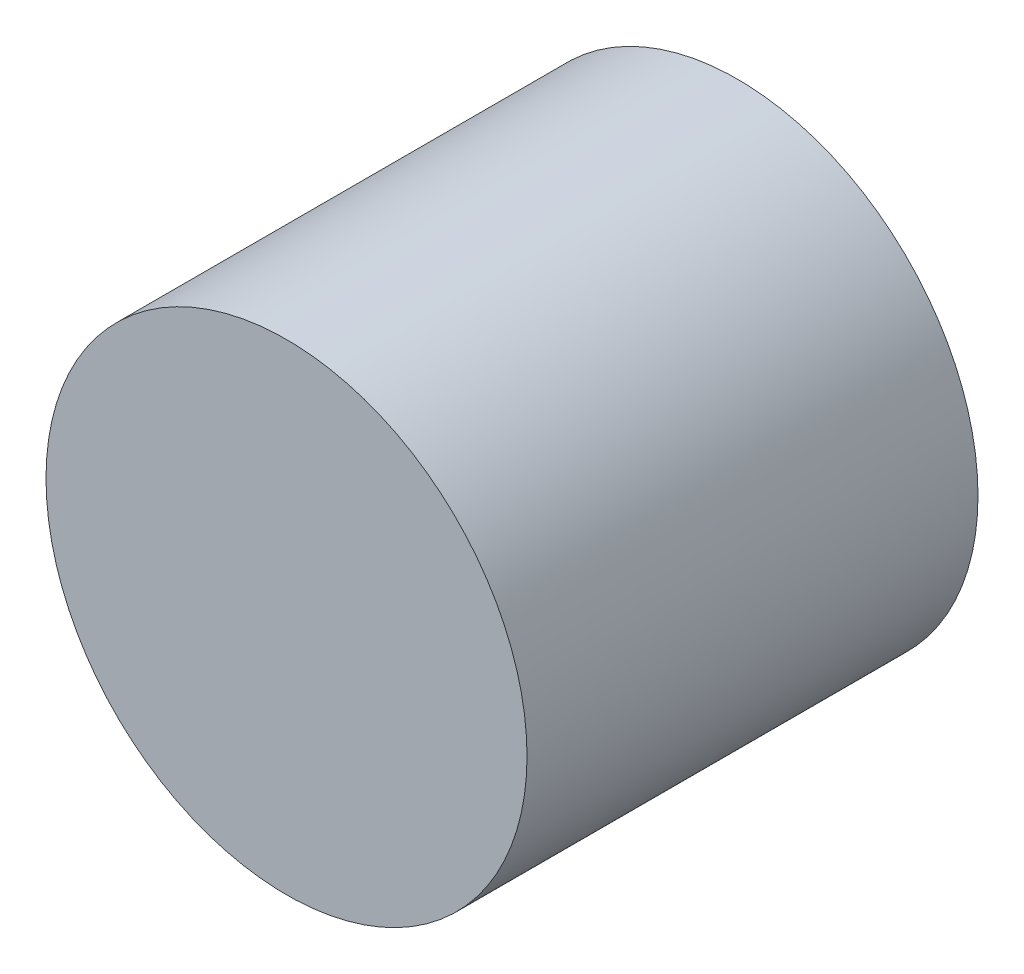
ISO-10303-21;
HEADER;
FILE_DESCRIPTION(('STEP AP214'),'2;1');
FILE_NAME('part.step','',(''),(''),'','','');
FILE_SCHEMA(('AUTOMOTIVE_DESIGN { 1 0 10303 214 1 1 1 1 }'));
ENDSEC;
DATA;
#1=APPLICATION_CONTEXT('core data for automotive mechanical design processes');
#2=APPLICATION_PROTOCOL_DEFINITION('international standard','automotive_design',2000,#1);
#3=PRODUCT_CONTEXT('',#1,'mechanical');
#4=PRODUCT('Part','Part','',(#3));
#5=PRODUCT_RELATED_PRODUCT_CATEGORY('part','',(#4));
#6=PRODUCT_DEFINITION_FORMATION('','',#4);
#7=PRODUCT_DEFINITION_CONTEXT('part definition',#1,'design');
#8=PRODUCT_DEFINITION('design','',#6,#7);
#9=PRODUCT_DEFINITION_SHAPE('','',#8);
#10=(LENGTH_UNIT() NAMED_UNIT(*) SI_UNIT(.MILLI.,.METRE.));
#11=(NAMED_UNIT(*) PLANE_ANGLE_UNIT() SI_UNIT($,.RADIAN.));
#12=(NAMED_UNIT(*) SI_UNIT($,.STERADIAN.) SOLID_ANGLE_UNIT());
#13=UNCERTAINTY_MEASURE_WITH_UNIT(LENGTH_MEASURE(1.E-05),#10,'distance_accuracy_value','');
#14=(GEOMETRIC_REPRESENTATION_CONTEXT(3) GLOBAL_UNCERTAINTY_ASSIGNED_CONTEXT((#13)) GLOBAL_UNIT_ASSIGNED_CONTEXT((#10,
#11,#12)) REPRESENTATION_CONTEXT('',''));
#15=CARTESIAN_POINT('',(0.,0.,0.));
#16=DIRECTION('',(0.,0.,1.));
#17=DIRECTION('',(1.,0.,0.));
#18=AXIS2_PLACEMENT_3D('',#15,#16,#17);
#19=CARTESIAN_POINT('',(0.,0.,150.));
#20=DIRECTION('',(0.,0.,-1.));
#21=DIRECTION('',(-1.,0.,0.));
#22=AXIS2_PLACEMENT_3D('',#19,#20,#21);
#23=CYLINDRICAL_SURFACE('',#22,80.);
#24=CARTESIAN_POINT('',(0.,0.,150.));
#25=DIRECTION('',(0.,0.,1.));
#26=DIRECTION('',(1.,0.,0.));
#27=AXIS2_PLACEMENT_3D('',#24,#25,#26);
#28=CIRCLE('',#27,80.);
#29=CARTESIAN_POINT('',(80.,0.,150.));
#30=VERTEX_POINT('',#29);
#31=EDGE_CURVE('E10',#30,#30,#28,.T.);
#32=ORIENTED_EDGE('',*,*,#31,.F.);
#33=EDGE_LOOP('',(#32));
#34=FACE_BOUND('',#33,.T.);
#35=CARTESIAN_POINT('',(0.,0.,0.));
#36=DIRECTION('',(0.,0.,1.));
#37=DIRECTION('',(1.,0.,0.));
#38=AXIS2_PLACEMENT_3D('',#35,#36,#37);
#39=CIRCLE('',#38,80.);
#40=CARTESIAN_POINT('',(80.,0.,0.));
#41=VERTEX_POINT('',#40);
#42=EDGE_CURVE('E40',#41,#41,#39,.T.);
#43=ORIENTED_EDGE('',*,*,#42,.T.);
#44=EDGE_LOOP('',(#43));
#45=FACE_BOUND('',#44,.T.);
#46=ADVANCED_FACE('F37',(#34,#45),#23,.T.);
#47=CARTESIAN_POINT('',(0.,0.,150.));
#48=DIRECTION('',(0.,0.,1.));
#49=DIRECTION('',(1.,0.,0.));
#50=AXIS2_PLACEMENT_3D('',#47,#48,#49);
#51=PLANE('',#50);
#52=ORIENTED_EDGE('',*,*,#31,.T.);
#53=EDGE_LOOP('',(#52));
#54=FACE_BOUND('',#53,.T.);
#55=ADVANCED_FACE('F54',(#54),#51,.T.);
#56=CARTESIAN_POINT('',(0.,0.,0.));
#57=DIRECTION('',(0.,0.,1.));
#58=DIRECTION('',(1.,0.,0.));
#59=AXIS2_PLACEMENT_3D('',#56,#57,#58);
#60=PLANE('',#59);
#61=ORIENTED_EDGE('',*,*,#42,.F.);
#62=EDGE_LOOP('',(#61));
#63=FACE_BOUND('',#62,.T.);
#64=ADVANCED_FACE('F52',(#63),#60,.F.);
#65=CLOSED_SHELL('',(#46,#55,#64));
#66=MANIFOLD_SOLID_BREP('B2',#65);
#67=ADVANCED_BREP_SHAPE_REPRESENTATION('',(#18,#66),#14);
#68=SHAPE_DEFINITION_REPRESENTATION(#9,#67);
ENDSEC;
END-ISO-10303-21;
